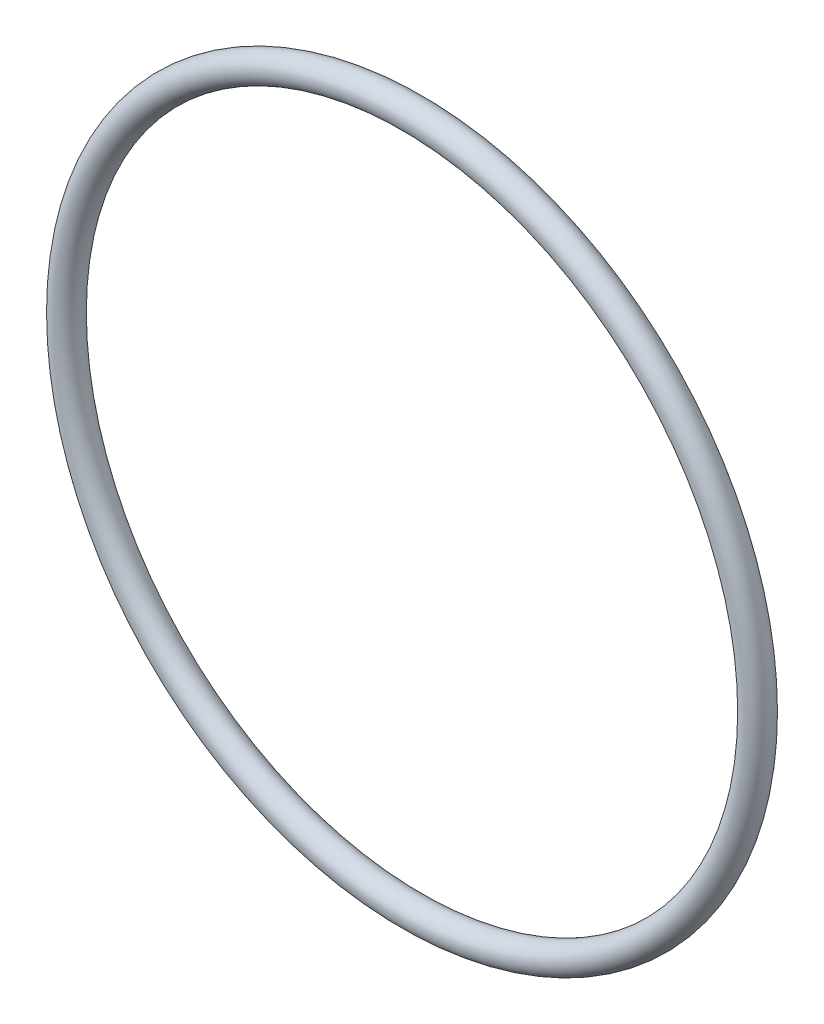
ISO-10303-21;
HEADER;
FILE_DESCRIPTION(('STEP AP214'),'2;1');
FILE_NAME('part.step','',(''),(''),'','','');
FILE_SCHEMA(('AUTOMOTIVE_DESIGN { 1 0 10303 214 1 1 1 1 }'));
ENDSEC;
DATA;
#1=APPLICATION_CONTEXT('core data for automotive mechanical design processes');
#2=APPLICATION_PROTOCOL_DEFINITION('international standard','automotive_design',2000,#1);
#3=PRODUCT_CONTEXT('',#1,'mechanical');
#4=PRODUCT('Part','Part','',(#3));
#5=PRODUCT_RELATED_PRODUCT_CATEGORY('part','',(#4));
#6=PRODUCT_DEFINITION_FORMATION('','',#4);
#7=PRODUCT_DEFINITION_CONTEXT('part definition',#1,'design');
#8=PRODUCT_DEFINITION('design','',#6,#7);
#9=PRODUCT_DEFINITION_SHAPE('','',#8);
#10=(LENGTH_UNIT() NAMED_UNIT(*) SI_UNIT(.MILLI.,.METRE.));
#11=(NAMED_UNIT(*) PLANE_ANGLE_UNIT() SI_UNIT($,.RADIAN.));
#12=(NAMED_UNIT(*) SI_UNIT($,.STERADIAN.) SOLID_ANGLE_UNIT());
#13=UNCERTAINTY_MEASURE_WITH_UNIT(LENGTH_MEASURE(1.E-05),#10,'distance_accuracy_value','');
#14=(GEOMETRIC_REPRESENTATION_CONTEXT(3) GLOBAL_UNCERTAINTY_ASSIGNED_CONTEXT((#13)) GLOBAL_UNIT_ASSIGNED_CONTEXT((#10,
#11,#12)) REPRESENTATION_CONTEXT('',''));
#15=CARTESIAN_POINT('',(0.,0.,0.));
#16=DIRECTION('',(0.,0.,1.));
#17=DIRECTION('',(1.,0.,0.));
#18=AXIS2_PLACEMENT_3D('',#15,#16,#17);
#19=CARTESIAN_POINT('',(0.,0.,0.));
#20=DIRECTION('',(0.,0.,1.));
#21=DIRECTION('',(1.,0.,0.));
#22=AXIS2_PLACEMENT_3D('',#19,#20,#21);
#23=TOROIDAL_SURFACE('',#22,32.1056,1.3081);
#24=CARTESIAN_POINT('',(33.4137,0.,0.));
#25=VERTEX_POINT('',#24);
#26=VERTEX_LOOP('',#25);
#27=FACE_BOUND('',#26,.T.);
#28=ADVANCED_FACE('F35',(#27),#23,.T.);
#29=CLOSED_SHELL('',(#28));
#30=MANIFOLD_SOLID_BREP('B2',#29);
#31=ADVANCED_BREP_SHAPE_REPRESENTATION('',(#18,#30),#14);
#32=SHAPE_DEFINITION_REPRESENTATION(#9,#31);
ENDSEC;
END-ISO-10303-21;
